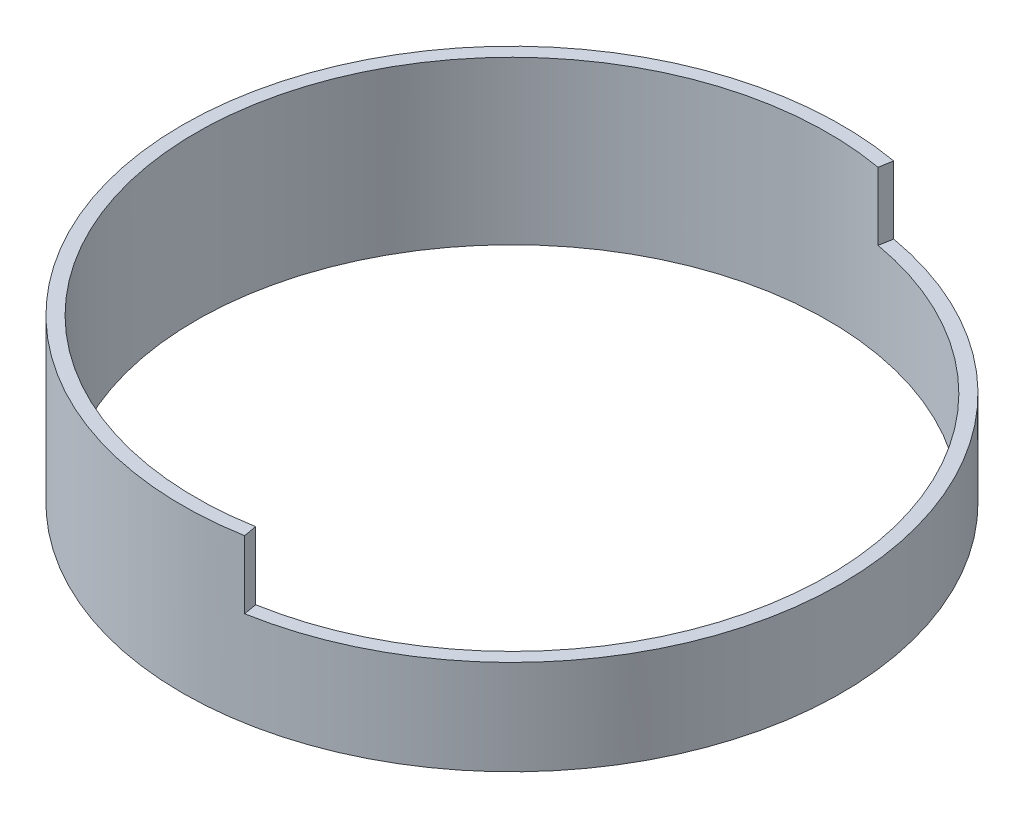
ISO-10303-21;
HEADER;
FILE_DESCRIPTION(('STEP AP214'),'2;1');
FILE_NAME('part.step','',(''),(''),'','','');
FILE_SCHEMA(('AUTOMOTIVE_DESIGN { 1 0 10303 214 1 1 1 1 }'));
ENDSEC;
DATA;
#1=APPLICATION_CONTEXT('core data for automotive mechanical design processes');
#2=APPLICATION_PROTOCOL_DEFINITION('international standard','automotive_design',2000,#1);
#3=PRODUCT_CONTEXT('',#1,'mechanical');
#4=PRODUCT('Part','Part','',(#3));
#5=PRODUCT_RELATED_PRODUCT_CATEGORY('part','',(#4));
#6=PRODUCT_DEFINITION_FORMATION('','',#4);
#7=PRODUCT_DEFINITION_CONTEXT('part definition',#1,'design');
#8=PRODUCT_DEFINITION('design','',#6,#7);
#9=PRODUCT_DEFINITION_SHAPE('','',#8);
#10=(LENGTH_UNIT() NAMED_UNIT(*) SI_UNIT(.MILLI.,.METRE.));
#11=(NAMED_UNIT(*) PLANE_ANGLE_UNIT() SI_UNIT($,.RADIAN.));
#12=(NAMED_UNIT(*) SI_UNIT($,.STERADIAN.) SOLID_ANGLE_UNIT());
#13=UNCERTAINTY_MEASURE_WITH_UNIT(LENGTH_MEASURE(1.E-05),#10,'distance_accuracy_value','');
#14=(GEOMETRIC_REPRESENTATION_CONTEXT(3) GLOBAL_UNCERTAINTY_ASSIGNED_CONTEXT((#13)) GLOBAL_UNIT_ASSIGNED_CONTEXT((#10,
#11,#12)) REPRESENTATION_CONTEXT('',''));
#15=CARTESIAN_POINT('',(0.,0.,0.));
#16=DIRECTION('',(0.,0.,1.));
#17=DIRECTION('',(1.,0.,0.));
#18=AXIS2_PLACEMENT_3D('',#15,#16,#17);
#19=CARTESIAN_POINT('',(0.,38.1,0.));
#20=DIRECTION('',(-0.984807753012209,0.,-0.173648177666928));
#21=DIRECTION('',(-0.173648177666928,0.,0.984807753012209));
#22=AXIS2_PLACEMENT_3D('',#19,#20,#21);
#23=PLANE('',#22);
#24=DIRECTION('',(0.,-1.,0.));
#25=VECTOR('',#24,1.);
#26=CARTESIAN_POINT('',(12.8742863111167,38.1,-73.0137058967903));
#27=LINE('',#26,#25);
#28=CARTESIAN_POINT('',(12.8742863111167,38.1,-73.0137058967903));
#29=VERTEX_POINT('',#28);
#30=CARTESIAN_POINT('',(12.8742863111167,22.225,-73.0137058967903));
#31=VERTEX_POINT('',#30);
#32=EDGE_CURVE('E63',#29,#31,#27,.T.);
#33=ORIENTED_EDGE('',*,*,#32,.T.);
#34=DIRECTION('',(0.173648177666928,0.,-0.984807753012209));
#35=VECTOR('',#34,1.);
#36=CARTESIAN_POINT('',(0.,22.225,0.));
#37=LINE('',#36,#35);
#38=CARTESIAN_POINT('',(13.4256192752091,22.225,-76.1404705126041));
#39=VERTEX_POINT('',#38);
#40=EDGE_CURVE('E59',#31,#39,#37,.T.);
#41=ORIENTED_EDGE('',*,*,#40,.T.);
#42=DIRECTION('',(0.,-1.,0.));
#43=VECTOR('',#42,1.);
#44=CARTESIAN_POINT('',(13.4256192752091,38.1,-76.1404705126041));
#45=LINE('',#44,#43);
#46=CARTESIAN_POINT('',(13.4256192752091,38.1,-76.1404705126041));
#47=VERTEX_POINT('',#46);
#48=EDGE_CURVE('E12',#47,#39,#45,.T.);
#49=ORIENTED_EDGE('',*,*,#48,.F.);
#50=DIRECTION('',(0.173648177666928,0.,-0.984807753012209));
#51=VECTOR('',#50,1.);
#52=CARTESIAN_POINT('',(0.,38.1,0.));
#53=LINE('',#52,#51);
#54=EDGE_CURVE('E111',#29,#47,#53,.T.);
#55=ORIENTED_EDGE('',*,*,#54,.F.);
#56=EDGE_LOOP('',(#33,#41,#49,#55));
#57=FACE_BOUND('',#56,.T.);
#58=ADVANCED_FACE('F45',(#57),#23,.F.);
#59=CARTESIAN_POINT('',(0.,38.1,0.));
#60=DIRECTION('',(0.,-1.,0.));
#61=DIRECTION('',(0.,0.,-1.));
#62=AXIS2_PLACEMENT_3D('',#59,#60,#61);
#63=CYLINDRICAL_SURFACE('',#62,77.31506);
#64=ORIENTED_EDGE('',*,*,#48,.T.);
#65=CARTESIAN_POINT('',(0.,22.225,0.));
#66=DIRECTION('',(0.,1.,0.));
#67=DIRECTION('',(0.,0.,1.));
#68=AXIS2_PLACEMENT_3D('',#65,#66,#67);
#69=CIRCLE('',#68,77.31506);
#70=CARTESIAN_POINT('',(13.4256192752091,22.225,76.1404705126041));
#71=VERTEX_POINT('',#70);
#72=EDGE_CURVE('E90',#71,#39,#69,.T.);
#73=ORIENTED_EDGE('',*,*,#72,.F.);
#74=DIRECTION('',(0.,-1.,0.));
#75=VECTOR('',#74,1.);
#76=CARTESIAN_POINT('',(13.4256192752091,38.1,76.1404705126041));
#77=LINE('',#76,#75);
#78=CARTESIAN_POINT('',(13.4256192752091,38.1,76.1404705126041));
#79=VERTEX_POINT('',#78);
#80=EDGE_CURVE('E52',#79,#71,#77,.T.);
#81=ORIENTED_EDGE('',*,*,#80,.F.);
#82=CARTESIAN_POINT('',(0.,38.1,0.));
#83=DIRECTION('',(0.,1.,0.));
#84=DIRECTION('',(0.,0.,1.));
#85=AXIS2_PLACEMENT_3D('',#82,#83,#84);
#86=CIRCLE('',#85,77.31506);
#87=EDGE_CURVE('E118',#47,#79,#86,.T.);
#88=ORIENTED_EDGE('',*,*,#87,.F.);
#89=EDGE_LOOP('',(#64,#73,#81,#88));
#90=FACE_BOUND('',#89,.T.);
#91=CARTESIAN_POINT('',(0.,0.,0.));
#92=DIRECTION('',(0.,1.,0.));
#93=DIRECTION('',(0.,0.,1.));
#94=AXIS2_PLACEMENT_3D('',#91,#92,#93);
#95=CIRCLE('',#94,77.31506);
#96=CARTESIAN_POINT('',(0.,0.,77.31506));
#97=VERTEX_POINT('',#96);
#98=EDGE_CURVE('E112',#97,#97,#95,.T.);
#99=ORIENTED_EDGE('',*,*,#98,.T.);
#100=EDGE_LOOP('',(#99));
#101=FACE_BOUND('',#100,.T.);
#102=ADVANCED_FACE('F124',(#90,#101),#63,.T.);
#103=CARTESIAN_POINT('',(0.,38.1,0.));
#104=DIRECTION('',(0.984807753012209,0.,-0.173648177666928));
#105=DIRECTION('',(-0.173648177666928,0.,-0.984807753012209));
#106=AXIS2_PLACEMENT_3D('',#103,#104,#105);
#107=PLANE('',#106);
#108=DIRECTION('',(0.173648177666928,0.,0.984807753012209));
#109=VECTOR('',#108,1.);
#110=CARTESIAN_POINT('',(0.,22.225,0.));
#111=LINE('',#110,#109);
#112=CARTESIAN_POINT('',(12.8742863111167,22.225,73.0137058967903));
#113=VERTEX_POINT('',#112);
#114=EDGE_CURVE('E86',#113,#71,#111,.T.);
#115=ORIENTED_EDGE('',*,*,#114,.F.);
#116=DIRECTION('',(0.,-1.,0.));
#117=VECTOR('',#116,1.);
#118=CARTESIAN_POINT('',(12.8742863111167,38.1,73.0137058967903));
#119=LINE('',#118,#117);
#120=CARTESIAN_POINT('',(12.8742863111167,38.1,73.0137058967903));
#121=VERTEX_POINT('',#120);
#122=EDGE_CURVE('E96',#121,#113,#119,.T.);
#123=ORIENTED_EDGE('',*,*,#122,.F.);
#124=DIRECTION('',(0.173648177666928,0.,0.984807753012209));
#125=VECTOR('',#124,1.);
#126=CARTESIAN_POINT('',(0.,38.1,0.));
#127=LINE('',#126,#125);
#128=EDGE_CURVE('E116',#121,#79,#127,.T.);
#129=ORIENTED_EDGE('',*,*,#128,.T.);
#130=ORIENTED_EDGE('',*,*,#80,.T.);
#131=EDGE_LOOP('',(#115,#123,#129,#130));
#132=FACE_BOUND('',#131,.T.);
#133=ADVANCED_FACE('F94',(#132),#107,.T.);
#134=CARTESIAN_POINT('',(0.,38.1,0.));
#135=DIRECTION('',(0.,-1.,0.));
#136=DIRECTION('',(0.,0.,-1.));
#137=AXIS2_PLACEMENT_3D('',#134,#135,#136);
#138=CYLINDRICAL_SURFACE('',#137,74.14006);
#139=CARTESIAN_POINT('',(0.,22.225,0.));
#140=DIRECTION('',(0.,1.,0.));
#141=DIRECTION('',(0.,0.,1.));
#142=AXIS2_PLACEMENT_3D('',#139,#140,#141);
#143=CIRCLE('',#142,74.14006);
#144=EDGE_CURVE('E82',#113,#31,#143,.T.);
#145=ORIENTED_EDGE('',*,*,#144,.T.);
#146=ORIENTED_EDGE('',*,*,#32,.F.);
#147=CARTESIAN_POINT('',(0.,38.1,0.));
#148=DIRECTION('',(0.,1.,0.));
#149=DIRECTION('',(0.,0.,1.));
#150=AXIS2_PLACEMENT_3D('',#147,#148,#149);
#151=CIRCLE('',#150,74.14006);
#152=EDGE_CURVE('E104',#29,#121,#151,.T.);
#153=ORIENTED_EDGE('',*,*,#152,.T.);
#154=ORIENTED_EDGE('',*,*,#122,.T.);
#155=EDGE_LOOP('',(#145,#146,#153,#154));
#156=FACE_BOUND('',#155,.T.);
#157=CARTESIAN_POINT('',(0.,0.,0.));
#158=DIRECTION('',(0.,1.,0.));
#159=DIRECTION('',(0.,0.,1.));
#160=AXIS2_PLACEMENT_3D('',#157,#158,#159);
#161=CIRCLE('',#160,74.14006);
#162=CARTESIAN_POINT('',(0.,0.,74.14006));
#163=VERTEX_POINT('',#162);
#164=EDGE_CURVE('E108',#163,#163,#161,.T.);
#165=ORIENTED_EDGE('',*,*,#164,.F.);
#166=EDGE_LOOP('',(#165));
#167=FACE_BOUND('',#166,.T.);
#168=ADVANCED_FACE('F101',(#156,#167),#138,.F.);
#169=CARTESIAN_POINT('',(0.,38.1,0.));
#170=DIRECTION('',(0.,1.,0.));
#171=DIRECTION('',(0.,0.,1.));
#172=AXIS2_PLACEMENT_3D('',#169,#170,#171);
#173=PLANE('',#172);
#174=ORIENTED_EDGE('',*,*,#54,.T.);
#175=ORIENTED_EDGE('',*,*,#87,.T.);
#176=ORIENTED_EDGE('',*,*,#128,.F.);
#177=ORIENTED_EDGE('',*,*,#152,.F.);
#178=EDGE_LOOP('',(#174,#175,#176,#177));
#179=FACE_BOUND('',#178,.T.);
#180=ADVANCED_FACE('F127',(#179),#173,.T.);
#181=CARTESIAN_POINT('',(0.,0.,0.));
#182=DIRECTION('',(0.,1.,0.));
#183=DIRECTION('',(0.,0.,1.));
#184=AXIS2_PLACEMENT_3D('',#181,#182,#183);
#185=PLANE('',#184);
#186=ORIENTED_EDGE('',*,*,#98,.F.);
#187=EDGE_LOOP('',(#186));
#188=FACE_BOUND('',#187,.T.);
#189=ORIENTED_EDGE('',*,*,#164,.T.);
#190=EDGE_LOOP('',(#189));
#191=FACE_BOUND('',#190,.T.);
#192=ADVANCED_FACE('F129',(#188,#191),#185,.F.);
#193=CARTESIAN_POINT('',(0.,22.225,0.));
#194=DIRECTION('',(0.,1.,0.));
#195=DIRECTION('',(0.,0.,1.));
#196=AXIS2_PLACEMENT_3D('',#193,#194,#195);
#197=PLANE('',#196);
#198=ORIENTED_EDGE('',*,*,#40,.F.);
#199=ORIENTED_EDGE('',*,*,#144,.F.);
#200=ORIENTED_EDGE('',*,*,#114,.T.);
#201=ORIENTED_EDGE('',*,*,#72,.T.);
#202=EDGE_LOOP('',(#198,#199,#200,#201));
#203=FACE_BOUND('',#202,.T.);
#204=ADVANCED_FACE('F84',(#203),#197,.T.);
#205=CLOSED_SHELL('',(#58,#102,#133,#168,#180,#192,#204));
#206=MANIFOLD_SOLID_BREP('B2',#205);
#207=ADVANCED_BREP_SHAPE_REPRESENTATION('',(#18,#206),#14);
#208=SHAPE_DEFINITION_REPRESENTATION(#9,#207);
ENDSEC;
END-ISO-10303-21;
